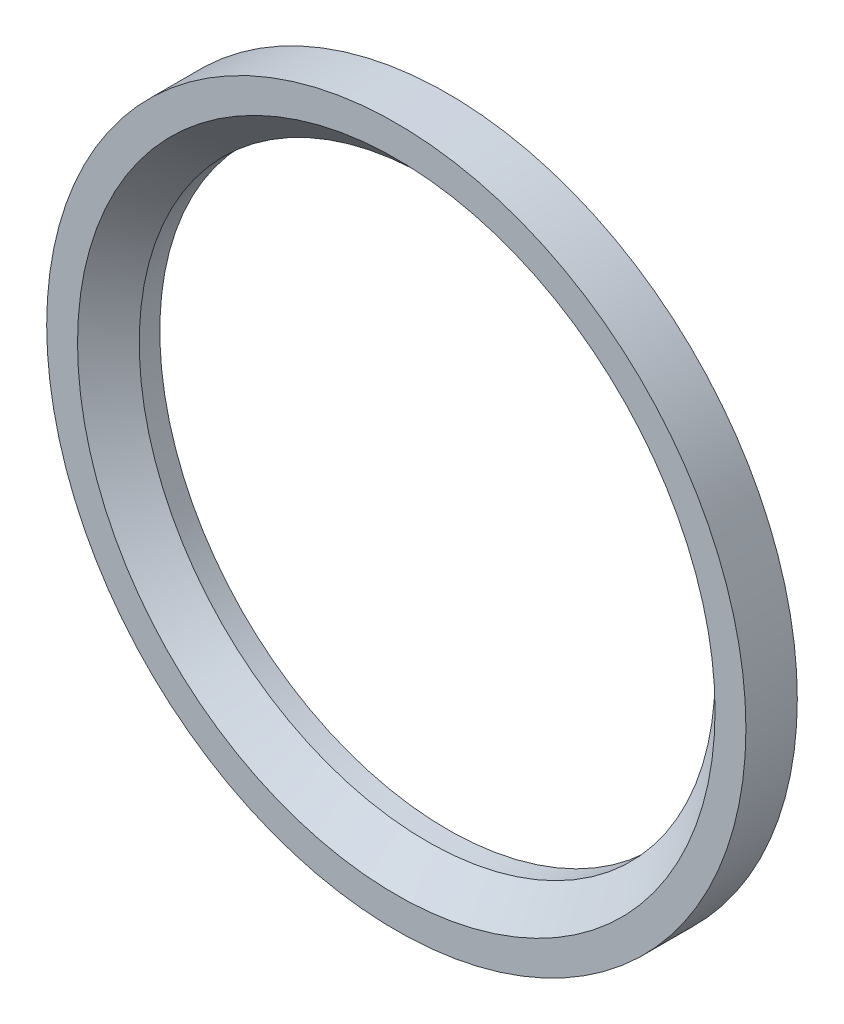
ISO-10303-21;
HEADER;
FILE_DESCRIPTION(('STEP AP214'),'2;1');
FILE_NAME('part.step','',(''),(''),'','','');
FILE_SCHEMA(('AUTOMOTIVE_DESIGN { 1 0 10303 214 1 1 1 1 }'));
ENDSEC;
DATA;
#1=APPLICATION_CONTEXT('core data for automotive mechanical design processes');
#2=APPLICATION_PROTOCOL_DEFINITION('international standard','automotive_design',2000,#1);
#3=PRODUCT_CONTEXT('',#1,'mechanical');
#4=PRODUCT('Part','Part','',(#3));
#5=PRODUCT_RELATED_PRODUCT_CATEGORY('part','',(#4));
#6=PRODUCT_DEFINITION_FORMATION('','',#4);
#7=PRODUCT_DEFINITION_CONTEXT('part definition',#1,'design');
#8=PRODUCT_DEFINITION('design','',#6,#7);
#9=PRODUCT_DEFINITION_SHAPE('','',#8);
#10=(LENGTH_UNIT() NAMED_UNIT(*) SI_UNIT(.MILLI.,.METRE.));
#11=(NAMED_UNIT(*) PLANE_ANGLE_UNIT() SI_UNIT($,.RADIAN.));
#12=(NAMED_UNIT(*) SI_UNIT($,.STERADIAN.) SOLID_ANGLE_UNIT());
#13=UNCERTAINTY_MEASURE_WITH_UNIT(LENGTH_MEASURE(1.E-05),#10,'distance_accuracy_value','');
#14=(GEOMETRIC_REPRESENTATION_CONTEXT(3) GLOBAL_UNCERTAINTY_ASSIGNED_CONTEXT((#13)) GLOBAL_UNIT_ASSIGNED_CONTEXT((#10,
#11,#12)) REPRESENTATION_CONTEXT('',''));
#15=CARTESIAN_POINT('',(0.,0.,0.));
#16=DIRECTION('',(0.,0.,1.));
#17=DIRECTION('',(1.,0.,0.));
#18=AXIS2_PLACEMENT_3D('',#15,#16,#17);
#19=CARTESIAN_POINT('',(0.,0.,2.5));
#20=DIRECTION('',(0.,0.,1.));
#21=DIRECTION('',(1.,0.,0.));
#22=AXIS2_PLACEMENT_3D('',#19,#20,#21);
#23=PLANE('',#22);
#24=CARTESIAN_POINT('',(0.,0.,2.5));
#25=DIRECTION('',(0.,0.,1.));
#26=DIRECTION('',(1.,0.,0.));
#27=AXIS2_PLACEMENT_3D('',#24,#25,#26);
#28=CIRCLE('',#27,15.5);
#29=CARTESIAN_POINT('',(15.5,0.,2.5));
#30=VERTEX_POINT('',#29);
#31=EDGE_CURVE('E10',#30,#30,#28,.F.);
#32=ORIENTED_EDGE('',*,*,#31,.T.);
#33=EDGE_LOOP('',(#32));
#34=FACE_BOUND('',#33,.T.);
#35=CARTESIAN_POINT('',(0.,0.,2.5));
#36=DIRECTION('',(0.,0.,1.));
#37=DIRECTION('',(1.,0.,0.));
#38=AXIS2_PLACEMENT_3D('',#35,#36,#37);
#39=CIRCLE('',#38,17.);
#40=CARTESIAN_POINT('',(17.,0.,2.5));
#41=VERTEX_POINT('',#40);
#42=EDGE_CURVE('E49',#41,#41,#39,.T.);
#43=ORIENTED_EDGE('',*,*,#42,.T.);
#44=EDGE_LOOP('',(#43));
#45=FACE_BOUND('',#44,.T.);
#46=ADVANCED_FACE('F36',(#34,#45),#23,.T.);
#47=CARTESIAN_POINT('',(0.,0.,0.));
#48=DIRECTION('',(0.,0.,1.));
#49=DIRECTION('',(1.,0.,0.));
#50=AXIS2_PLACEMENT_3D('',#47,#48,#49);
#51=PLANE('',#50);
#52=CARTESIAN_POINT('',(0.,0.,0.));
#53=DIRECTION('',(0.,0.,1.));
#54=DIRECTION('',(1.,0.,0.));
#55=AXIS2_PLACEMENT_3D('',#52,#53,#54);
#56=CIRCLE('',#55,17.);
#57=CARTESIAN_POINT('',(17.,0.,0.));
#58=VERTEX_POINT('',#57);
#59=EDGE_CURVE('E54',#58,#58,#56,.T.);
#60=ORIENTED_EDGE('',*,*,#59,.F.);
#61=EDGE_LOOP('',(#60));
#62=FACE_BOUND('',#61,.T.);
#63=CARTESIAN_POINT('',(0.,0.,0.));
#64=DIRECTION('',(0.,0.,1.));
#65=DIRECTION('',(1.,0.,0.));
#66=AXIS2_PLACEMENT_3D('',#63,#64,#65);
#67=CIRCLE('',#66,14.);
#68=CARTESIAN_POINT('',(14.,0.,0.));
#69=VERTEX_POINT('',#68);
#70=EDGE_CURVE('E59',#69,#69,#67,.T.);
#71=ORIENTED_EDGE('',*,*,#70,.T.);
#72=EDGE_LOOP('',(#71));
#73=FACE_BOUND('',#72,.T.);
#74=ADVANCED_FACE('F65',(#62,#73),#51,.F.);
#75=CARTESIAN_POINT('',(0.,0.,2.5));
#76=DIRECTION('',(0.,0.,-1.));
#77=DIRECTION('',(-1.,0.,0.));
#78=AXIS2_PLACEMENT_3D('',#75,#76,#77);
#79=CYLINDRICAL_SURFACE('',#78,17.);
#80=ORIENTED_EDGE('',*,*,#42,.F.);
#81=EDGE_LOOP('',(#80));
#82=FACE_BOUND('',#81,.T.);
#83=ORIENTED_EDGE('',*,*,#59,.T.);
#84=EDGE_LOOP('',(#83));
#85=FACE_BOUND('',#84,.T.);
#86=ADVANCED_FACE('F69',(#82,#85),#79,.T.);
#87=CARTESIAN_POINT('',(0.,0.,2.5));
#88=DIRECTION('',(0.,0.,-1.));
#89=DIRECTION('',(-1.,0.,0.));
#90=AXIS2_PLACEMENT_3D('',#87,#88,#89);
#91=CYLINDRICAL_SURFACE('',#90,14.);
#92=CARTESIAN_POINT('',(0.,0.,1.00000000000001));
#93=DIRECTION('',(0.,0.,1.));
#94=DIRECTION('',(1.,0.,0.));
#95=AXIS2_PLACEMENT_3D('',#92,#93,#94);
#96=CIRCLE('',#95,14.);
#97=CARTESIAN_POINT('',(14.,0.,1.00000000000001));
#98=VERTEX_POINT('',#97);
#99=EDGE_CURVE('E44',#98,#98,#96,.T.);
#100=ORIENTED_EDGE('',*,*,#99,.T.);
#101=EDGE_LOOP('',(#100));
#102=FACE_BOUND('',#101,.T.);
#103=ORIENTED_EDGE('',*,*,#70,.F.);
#104=EDGE_LOOP('',(#103));
#105=FACE_BOUND('',#104,.T.);
#106=ADVANCED_FACE('F67',(#102,#105),#91,.F.);
#107=CARTESIAN_POINT('',(0.,0.,1.00000000000001));
#108=DIRECTION('',(0.,0.,1.));
#109=DIRECTION('',(1.,0.,0.));
#110=AXIS2_PLACEMENT_3D('',#107,#108,#109);
#111=CONICAL_SURFACE('',#110,14.,0.785398163397451);
#112=ORIENTED_EDGE('',*,*,#31,.F.);
#113=EDGE_LOOP('',(#112));
#114=FACE_BOUND('',#113,.T.);
#115=ORIENTED_EDGE('',*,*,#99,.F.);
#116=EDGE_LOOP('',(#115));
#117=FACE_BOUND('',#116,.T.);
#118=ADVANCED_FACE('F38',(#114,#117),#111,.F.);
#119=CLOSED_SHELL('',(#46,#74,#86,#106,#118));
#120=MANIFOLD_SOLID_BREP('B2',#119);
#121=ADVANCED_BREP_SHAPE_REPRESENTATION('',(#18,#120),#14);
#122=SHAPE_DEFINITION_REPRESENTATION(#9,#121);
ENDSEC;
END-ISO-10303-21;
